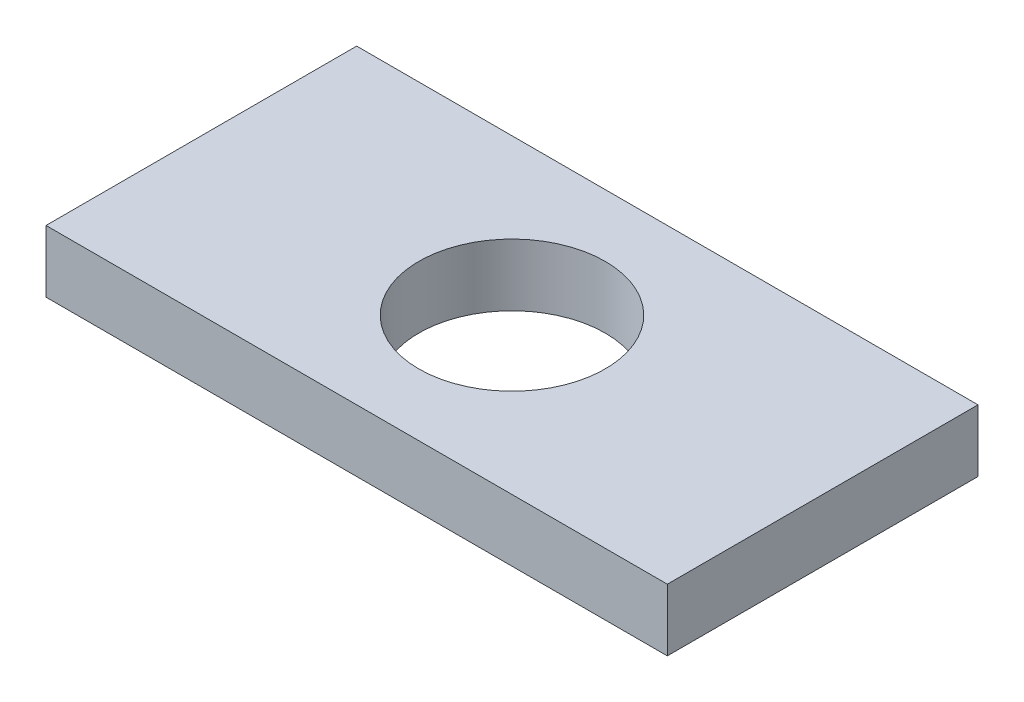
ISO-10303-21;
HEADER;
FILE_DESCRIPTION(('STEP AP214'),'2;1');
FILE_NAME('part.step','',(''),(''),'','','');
FILE_SCHEMA(('AUTOMOTIVE_DESIGN { 1 0 10303 214 1 1 1 1 }'));
ENDSEC;
DATA;
#1=APPLICATION_CONTEXT('core data for automotive mechanical design processes');
#2=APPLICATION_PROTOCOL_DEFINITION('international standard','automotive_design',2000,#1);
#3=PRODUCT_CONTEXT('',#1,'mechanical');
#4=PRODUCT('Part','Part','',(#3));
#5=PRODUCT_RELATED_PRODUCT_CATEGORY('part','',(#4));
#6=PRODUCT_DEFINITION_FORMATION('','',#4);
#7=PRODUCT_DEFINITION_CONTEXT('part definition',#1,'design');
#8=PRODUCT_DEFINITION('design','',#6,#7);
#9=PRODUCT_DEFINITION_SHAPE('','',#8);
#10=(LENGTH_UNIT() NAMED_UNIT(*) SI_UNIT(.MILLI.,.METRE.));
#11=(NAMED_UNIT(*) PLANE_ANGLE_UNIT() SI_UNIT($,.RADIAN.));
#12=(NAMED_UNIT(*) SI_UNIT($,.STERADIAN.) SOLID_ANGLE_UNIT());
#13=UNCERTAINTY_MEASURE_WITH_UNIT(LENGTH_MEASURE(1.E-05),#10,'distance_accuracy_value','');
#14=(GEOMETRIC_REPRESENTATION_CONTEXT(3) GLOBAL_UNCERTAINTY_ASSIGNED_CONTEXT((#13)) GLOBAL_UNIT_ASSIGNED_CONTEXT((#10,
#11,#12)) REPRESENTATION_CONTEXT('',''));
#15=CARTESIAN_POINT('',(0.,0.,0.));
#16=DIRECTION('',(0.,0.,1.));
#17=DIRECTION('',(1.,0.,0.));
#18=AXIS2_PLACEMENT_3D('',#15,#16,#17);
#19=CARTESIAN_POINT('',(0.,4.,0.));
#20=DIRECTION('',(1.,0.,0.));
#21=DIRECTION('',(0.,0.,-1.));
#22=AXIS2_PLACEMENT_3D('',#19,#20,#21);
#23=PLANE('',#22);
#24=DIRECTION('',(0.,0.,1.));
#25=VECTOR('',#24,1.);
#26=CARTESIAN_POINT('',(0.,0.,0.));
#27=LINE('',#26,#25);
#28=CARTESIAN_POINT('',(0.,0.,-20.));
#29=VERTEX_POINT('',#28);
#30=CARTESIAN_POINT('',(0.,0.,0.));
#31=VERTEX_POINT('',#30);
#32=EDGE_CURVE('E97',#29,#31,#27,.T.);
#33=ORIENTED_EDGE('',*,*,#32,.T.);
#34=DIRECTION('',(0.,-1.,0.));
#35=VECTOR('',#34,1.);
#36=CARTESIAN_POINT('',(0.,4.,0.));
#37=LINE('',#36,#35);
#38=CARTESIAN_POINT('',(0.,4.,0.));
#39=VERTEX_POINT('',#38);
#40=EDGE_CURVE('E11',#39,#31,#37,.T.);
#41=ORIENTED_EDGE('',*,*,#40,.F.);
#42=DIRECTION('',(0.,0.,1.));
#43=VECTOR('',#42,1.);
#44=CARTESIAN_POINT('',(0.,4.,0.));
#45=LINE('',#44,#43);
#46=CARTESIAN_POINT('',(0.,4.,-20.));
#47=VERTEX_POINT('',#46);
#48=EDGE_CURVE('E85',#47,#39,#45,.T.);
#49=ORIENTED_EDGE('',*,*,#48,.F.);
#50=DIRECTION('',(0.,-1.,0.));
#51=VECTOR('',#50,1.);
#52=CARTESIAN_POINT('',(0.,4.,-20.));
#53=LINE('',#52,#51);
#54=EDGE_CURVE('E93',#47,#29,#53,.T.);
#55=ORIENTED_EDGE('',*,*,#54,.T.);
#56=EDGE_LOOP('',(#33,#41,#49,#55));
#57=FACE_BOUND('',#56,.T.);
#58=ADVANCED_FACE('F34',(#57),#23,.F.);
#59=CARTESIAN_POINT('',(0.,4.,0.));
#60=DIRECTION('',(0.,0.,-1.));
#61=DIRECTION('',(-1.,0.,0.));
#62=AXIS2_PLACEMENT_3D('',#59,#60,#61);
#63=PLANE('',#62);
#64=DIRECTION('',(1.,0.,0.));
#65=VECTOR('',#64,1.);
#66=CARTESIAN_POINT('',(0.,0.,0.));
#67=LINE('',#66,#65);
#68=CARTESIAN_POINT('',(40.,0.,0.));
#69=VERTEX_POINT('',#68);
#70=EDGE_CURVE('E89',#31,#69,#67,.T.);
#71=ORIENTED_EDGE('',*,*,#70,.T.);
#72=DIRECTION('',(0.,-1.,0.));
#73=VECTOR('',#72,1.);
#74=CARTESIAN_POINT('',(40.,4.,0.));
#75=LINE('',#74,#73);
#76=CARTESIAN_POINT('',(40.,4.,0.));
#77=VERTEX_POINT('',#76);
#78=EDGE_CURVE('E42',#77,#69,#75,.T.);
#79=ORIENTED_EDGE('',*,*,#78,.F.);
#80=DIRECTION('',(1.,0.,0.));
#81=VECTOR('',#80,1.);
#82=CARTESIAN_POINT('',(0.,4.,0.));
#83=LINE('',#82,#81);
#84=EDGE_CURVE('E80',#39,#77,#83,.T.);
#85=ORIENTED_EDGE('',*,*,#84,.F.);
#86=ORIENTED_EDGE('',*,*,#40,.T.);
#87=EDGE_LOOP('',(#71,#79,#85,#86));
#88=FACE_BOUND('',#87,.T.);
#89=ADVANCED_FACE('F88',(#88),#63,.F.);
#90=CARTESIAN_POINT('',(40.,4.,0.));
#91=DIRECTION('',(-1.,0.,0.));
#92=DIRECTION('',(0.,0.,1.));
#93=AXIS2_PLACEMENT_3D('',#90,#91,#92);
#94=PLANE('',#93);
#95=DIRECTION('',(0.,0.,-1.));
#96=VECTOR('',#95,1.);
#97=CARTESIAN_POINT('',(40.,0.,0.));
#98=LINE('',#97,#96);
#99=CARTESIAN_POINT('',(40.,0.,-20.));
#100=VERTEX_POINT('',#99);
#101=EDGE_CURVE('E67',#69,#100,#98,.T.);
#102=ORIENTED_EDGE('',*,*,#101,.T.);
#103=DIRECTION('',(0.,-1.,0.));
#104=VECTOR('',#103,1.);
#105=CARTESIAN_POINT('',(40.,4.,-20.));
#106=LINE('',#105,#104);
#107=CARTESIAN_POINT('',(40.,4.,-20.));
#108=VERTEX_POINT('',#107);
#109=EDGE_CURVE('E90',#108,#100,#106,.T.);
#110=ORIENTED_EDGE('',*,*,#109,.F.);
#111=DIRECTION('',(0.,0.,-1.));
#112=VECTOR('',#111,1.);
#113=CARTESIAN_POINT('',(40.,4.,0.));
#114=LINE('',#113,#112);
#115=EDGE_CURVE('E83',#77,#108,#114,.T.);
#116=ORIENTED_EDGE('',*,*,#115,.F.);
#117=ORIENTED_EDGE('',*,*,#78,.T.);
#118=EDGE_LOOP('',(#102,#110,#116,#117));
#119=FACE_BOUND('',#118,.T.);
#120=ADVANCED_FACE('F91',(#119),#94,.F.);
#121=CARTESIAN_POINT('',(0.,4.,-20.));
#122=DIRECTION('',(0.,0.,1.));
#123=DIRECTION('',(1.,0.,0.));
#124=AXIS2_PLACEMENT_3D('',#121,#122,#123);
#125=PLANE('',#124);
#126=DIRECTION('',(-1.,0.,0.));
#127=VECTOR('',#126,1.);
#128=CARTESIAN_POINT('',(0.,0.,-20.));
#129=LINE('',#128,#127);
#130=EDGE_CURVE('E73',#100,#29,#129,.T.);
#131=ORIENTED_EDGE('',*,*,#130,.T.);
#132=ORIENTED_EDGE('',*,*,#54,.F.);
#133=DIRECTION('',(-1.,0.,0.));
#134=VECTOR('',#133,1.);
#135=CARTESIAN_POINT('',(0.,4.,-20.));
#136=LINE('',#135,#134);
#137=EDGE_CURVE('E50',#108,#47,#136,.T.);
#138=ORIENTED_EDGE('',*,*,#137,.F.);
#139=ORIENTED_EDGE('',*,*,#109,.T.);
#140=EDGE_LOOP('',(#131,#132,#138,#139));
#141=FACE_BOUND('',#140,.T.);
#142=ADVANCED_FACE('F105',(#141),#125,.F.);
#143=CARTESIAN_POINT('',(0.,4.,0.));
#144=DIRECTION('',(0.,-1.,0.));
#145=DIRECTION('',(0.,0.,-1.));
#146=AXIS2_PLACEMENT_3D('',#143,#144,#145);
#147=PLANE('',#146);
#148=CARTESIAN_POINT('',(20.,4.,-10.));
#149=DIRECTION('',(0.,1.,0.));
#150=DIRECTION('',(0.,0.,1.));
#151=AXIS2_PLACEMENT_3D('',#148,#149,#150);
#152=CIRCLE('',#151,6.);
#153=CARTESIAN_POINT('',(20.,4.,-4.));
#154=VERTEX_POINT('',#153);
#155=EDGE_CURVE('E111',#154,#154,#152,.T.);
#156=ORIENTED_EDGE('',*,*,#155,.F.);
#157=EDGE_LOOP('',(#156));
#158=FACE_BOUND('',#157,.T.);
#159=ORIENTED_EDGE('',*,*,#48,.T.);
#160=ORIENTED_EDGE('',*,*,#84,.T.);
#161=ORIENTED_EDGE('',*,*,#115,.T.);
#162=ORIENTED_EDGE('',*,*,#137,.T.);
#163=EDGE_LOOP('',(#159,#160,#161,#162));
#164=FACE_BOUND('',#163,.T.);
#165=ADVANCED_FACE('F81',(#158,#164),#147,.F.);
#166=CARTESIAN_POINT('',(0.,0.,0.));
#167=DIRECTION('',(0.,-1.,0.));
#168=DIRECTION('',(0.,0.,-1.));
#169=AXIS2_PLACEMENT_3D('',#166,#167,#168);
#170=PLANE('',#169);
#171=CARTESIAN_POINT('',(20.,0.,-10.));
#172=DIRECTION('',(0.,1.,0.));
#173=DIRECTION('',(0.,0.,1.));
#174=AXIS2_PLACEMENT_3D('',#171,#172,#173);
#175=CIRCLE('',#174,6.);
#176=CARTESIAN_POINT('',(20.,0.,-4.));
#177=VERTEX_POINT('',#176);
#178=EDGE_CURVE('E100',#177,#177,#175,.T.);
#179=ORIENTED_EDGE('',*,*,#178,.T.);
#180=EDGE_LOOP('',(#179));
#181=FACE_BOUND('',#180,.T.);
#182=ORIENTED_EDGE('',*,*,#32,.F.);
#183=ORIENTED_EDGE('',*,*,#130,.F.);
#184=ORIENTED_EDGE('',*,*,#101,.F.);
#185=ORIENTED_EDGE('',*,*,#70,.F.);
#186=EDGE_LOOP('',(#182,#183,#184,#185));
#187=FACE_BOUND('',#186,.T.);
#188=ADVANCED_FACE('F108',(#181,#187),#170,.T.);
#189=CARTESIAN_POINT('',(20.,0.,-10.));
#190=DIRECTION('',(0.,1.,0.));
#191=DIRECTION('',(0.,0.,1.));
#192=AXIS2_PLACEMENT_3D('',#189,#190,#191);
#193=CYLINDRICAL_SURFACE('',#192,6.);
#194=ORIENTED_EDGE('',*,*,#178,.F.);
#195=EDGE_LOOP('',(#194));
#196=FACE_BOUND('',#195,.T.);
#197=ORIENTED_EDGE('',*,*,#155,.T.);
#198=EDGE_LOOP('',(#197));
#199=FACE_BOUND('',#198,.T.);
#200=ADVANCED_FACE('F118',(#196,#199),#193,.F.);
#201=CLOSED_SHELL('',(#58,#89,#120,#142,#165,#188,#200));
#202=MANIFOLD_SOLID_BREP('B2',#201);
#203=ADVANCED_BREP_SHAPE_REPRESENTATION('',(#18,#202),#14);
#204=SHAPE_DEFINITION_REPRESENTATION(#9,#203);
ENDSEC;
END-ISO-10303-21;
